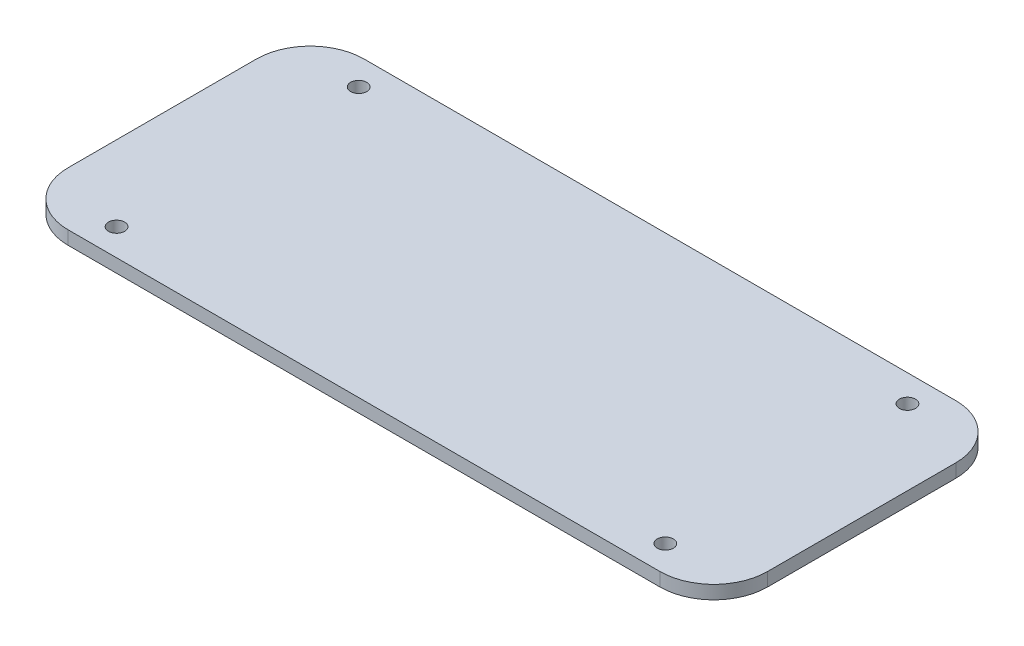
ISO-10303-21;
HEADER;
FILE_DESCRIPTION(('STEP AP214'),'2;1');
FILE_NAME('part.step','',(''),(''),'','','');
FILE_SCHEMA(('AUTOMOTIVE_DESIGN { 1 0 10303 214 1 1 1 1 }'));
ENDSEC;
DATA;
#1=APPLICATION_CONTEXT('core data for automotive mechanical design processes');
#2=APPLICATION_PROTOCOL_DEFINITION('international standard','automotive_design',2000,#1);
#3=PRODUCT_CONTEXT('',#1,'mechanical');
#4=PRODUCT('Part','Part','',(#3));
#5=PRODUCT_RELATED_PRODUCT_CATEGORY('part','',(#4));
#6=PRODUCT_DEFINITION_FORMATION('','',#4);
#7=PRODUCT_DEFINITION_CONTEXT('part definition',#1,'design');
#8=PRODUCT_DEFINITION('design','',#6,#7);
#9=PRODUCT_DEFINITION_SHAPE('','',#8);
#10=(LENGTH_UNIT() NAMED_UNIT(*) SI_UNIT(.MILLI.,.METRE.));
#11=(NAMED_UNIT(*) PLANE_ANGLE_UNIT() SI_UNIT($,.RADIAN.));
#12=(NAMED_UNIT(*) SI_UNIT($,.STERADIAN.) SOLID_ANGLE_UNIT());
#13=UNCERTAINTY_MEASURE_WITH_UNIT(LENGTH_MEASURE(1.E-05),#10,'distance_accuracy_value','');
#14=(GEOMETRIC_REPRESENTATION_CONTEXT(3) GLOBAL_UNCERTAINTY_ASSIGNED_CONTEXT((#13)) GLOBAL_UNIT_ASSIGNED_CONTEXT((#10,
#11,#12)) REPRESENTATION_CONTEXT('',''));
#15=CARTESIAN_POINT('',(0.,0.,0.));
#16=DIRECTION('',(0.,0.,1.));
#17=DIRECTION('',(1.,0.,0.));
#18=AXIS2_PLACEMENT_3D('',#15,#16,#17);
#19=CARTESIAN_POINT('',(10.,2.5,-45.));
#20=DIRECTION('',(0.,-1.,0.));
#21=DIRECTION('',(0.,0.,-1.));
#22=AXIS2_PLACEMENT_3D('',#19,#20,#21);
#23=CYLINDRICAL_SURFACE('',#22,10.);
#24=CARTESIAN_POINT('',(10.,0.,-45.));
#25=DIRECTION('',(0.,1.,0.));
#26=DIRECTION('',(0.,0.,1.));
#27=AXIS2_PLACEMENT_3D('',#24,#25,#26);
#28=CIRCLE('',#27,10.);
#29=CARTESIAN_POINT('',(10.0000000000001,0.,-55.));
#30=VERTEX_POINT('',#29);
#31=CARTESIAN_POINT('',(0.,0.,-44.9999999999999));
#32=VERTEX_POINT('',#31);
#33=EDGE_CURVE('E129',#30,#32,#28,.T.);
#34=ORIENTED_EDGE('',*,*,#33,.T.);
#35=DIRECTION('',(0.,-1.,0.));
#36=VECTOR('',#35,1.);
#37=CARTESIAN_POINT('',(0.,2.5,-44.9999999999999));
#38=LINE('',#37,#36);
#39=CARTESIAN_POINT('',(0.,2.5,-44.9999999999999));
#40=VERTEX_POINT('',#39);
#41=EDGE_CURVE('E11',#40,#32,#38,.T.);
#42=ORIENTED_EDGE('',*,*,#41,.F.);
#43=CARTESIAN_POINT('',(10.,2.5,-45.));
#44=DIRECTION('',(0.,1.,0.));
#45=DIRECTION('',(0.,0.,1.));
#46=AXIS2_PLACEMENT_3D('',#43,#44,#45);
#47=CIRCLE('',#46,10.);
#48=CARTESIAN_POINT('',(10.0000000000001,2.5,-55.));
#49=VERTEX_POINT('',#48);
#50=EDGE_CURVE('E144',#49,#40,#47,.T.);
#51=ORIENTED_EDGE('',*,*,#50,.F.);
#52=DIRECTION('',(0.,-1.,0.));
#53=VECTOR('',#52,1.);
#54=CARTESIAN_POINT('',(10.0000000000001,2.5,-55.));
#55=LINE('',#54,#53);
#56=EDGE_CURVE('E125',#49,#30,#55,.T.);
#57=ORIENTED_EDGE('',*,*,#56,.T.);
#58=EDGE_LOOP('',(#34,#42,#51,#57));
#59=FACE_BOUND('',#58,.T.);
#60=ADVANCED_FACE('F33',(#59),#23,.T.);
#61=CARTESIAN_POINT('',(0.,2.5,-10.0000000000001));
#62=DIRECTION('',(1.,0.,0.));
#63=DIRECTION('',(0.,0.,-1.));
#64=AXIS2_PLACEMENT_3D('',#61,#62,#63);
#65=PLANE('',#64);
#66=DIRECTION('',(0.,0.,1.));
#67=VECTOR('',#66,1.);
#68=CARTESIAN_POINT('',(0.,0.,-10.0000000000001));
#69=LINE('',#68,#67);
#70=CARTESIAN_POINT('',(0.,0.,-10.0000000000001));
#71=VERTEX_POINT('',#70);
#72=EDGE_CURVE('E132',#32,#71,#69,.T.);
#73=ORIENTED_EDGE('',*,*,#72,.T.);
#74=DIRECTION('',(0.,-1.,0.));
#75=VECTOR('',#74,1.);
#76=CARTESIAN_POINT('',(0.,2.5,-10.0000000000001));
#77=LINE('',#76,#75);
#78=CARTESIAN_POINT('',(0.,2.5,-10.0000000000001));
#79=VERTEX_POINT('',#78);
#80=EDGE_CURVE('E41',#79,#71,#77,.T.);
#81=ORIENTED_EDGE('',*,*,#80,.F.);
#82=DIRECTION('',(0.,0.,1.));
#83=VECTOR('',#82,1.);
#84=CARTESIAN_POINT('',(0.,2.5,-10.0000000000001));
#85=LINE('',#84,#83);
#86=EDGE_CURVE('E92',#40,#79,#85,.T.);
#87=ORIENTED_EDGE('',*,*,#86,.F.);
#88=ORIENTED_EDGE('',*,*,#41,.T.);
#89=EDGE_LOOP('',(#73,#81,#87,#88));
#90=FACE_BOUND('',#89,.T.);
#91=ADVANCED_FACE('F235',(#90),#65,.F.);
#92=CARTESIAN_POINT('',(10.,2.5,-10.));
#93=DIRECTION('',(0.,-1.,0.));
#94=DIRECTION('',(0.,0.,-1.));
#95=AXIS2_PLACEMENT_3D('',#92,#93,#94);
#96=CYLINDRICAL_SURFACE('',#95,10.);
#97=CARTESIAN_POINT('',(10.,0.,-10.));
#98=DIRECTION('',(0.,1.,0.));
#99=DIRECTION('',(0.,0.,1.));
#100=AXIS2_PLACEMENT_3D('',#97,#98,#99);
#101=CIRCLE('',#100,10.);
#102=CARTESIAN_POINT('',(10.0000000000001,0.,0.));
#103=VERTEX_POINT('',#102);
#104=EDGE_CURVE('E135',#71,#103,#101,.T.);
#105=ORIENTED_EDGE('',*,*,#104,.T.);
#106=DIRECTION('',(0.,-1.,0.));
#107=VECTOR('',#106,1.);
#108=CARTESIAN_POINT('',(10.0000000000001,2.5,0.));
#109=LINE('',#108,#107);
#110=CARTESIAN_POINT('',(10.0000000000001,2.5,0.));
#111=VERTEX_POINT('',#110);
#112=EDGE_CURVE('E151',#111,#103,#109,.T.);
#113=ORIENTED_EDGE('',*,*,#112,.F.);
#114=CARTESIAN_POINT('',(10.,2.5,-10.));
#115=DIRECTION('',(0.,1.,0.));
#116=DIRECTION('',(0.,0.,1.));
#117=AXIS2_PLACEMENT_3D('',#114,#115,#116);
#118=CIRCLE('',#117,10.);
#119=EDGE_CURVE('E159',#79,#111,#118,.T.);
#120=ORIENTED_EDGE('',*,*,#119,.F.);
#121=ORIENTED_EDGE('',*,*,#80,.T.);
#122=EDGE_LOOP('',(#105,#113,#120,#121));
#123=FACE_BOUND('',#122,.T.);
#124=ADVANCED_FACE('F157',(#123),#96,.T.);
#125=CARTESIAN_POINT('',(10.0000000000001,2.5,0.));
#126=DIRECTION('',(0.,0.,-1.));
#127=DIRECTION('',(-1.,0.,0.));
#128=AXIS2_PLACEMENT_3D('',#125,#126,#127);
#129=PLANE('',#128);
#130=DIRECTION('',(1.,0.,0.));
#131=VECTOR('',#130,1.);
#132=CARTESIAN_POINT('',(10.0000000000001,0.,0.));
#133=LINE('',#132,#131);
#134=CARTESIAN_POINT('',(120.,0.,0.));
#135=VERTEX_POINT('',#134);
#136=EDGE_CURVE('E137',#103,#135,#133,.T.);
#137=ORIENTED_EDGE('',*,*,#136,.T.);
#138=DIRECTION('',(0.,-1.,0.));
#139=VECTOR('',#138,1.);
#140=CARTESIAN_POINT('',(120.,2.5,0.));
#141=LINE('',#140,#139);
#142=CARTESIAN_POINT('',(120.,2.5,0.));
#143=VERTEX_POINT('',#142);
#144=EDGE_CURVE('E148',#143,#135,#141,.T.);
#145=ORIENTED_EDGE('',*,*,#144,.F.);
#146=DIRECTION('',(1.,0.,0.));
#147=VECTOR('',#146,1.);
#148=CARTESIAN_POINT('',(10.0000000000001,2.5,0.));
#149=LINE('',#148,#147);
#150=EDGE_CURVE('E171',#111,#143,#149,.T.);
#151=ORIENTED_EDGE('',*,*,#150,.F.);
#152=ORIENTED_EDGE('',*,*,#112,.T.);
#153=EDGE_LOOP('',(#137,#145,#151,#152));
#154=FACE_BOUND('',#153,.T.);
#155=ADVANCED_FACE('F167',(#154),#129,.F.);
#156=CARTESIAN_POINT('',(120.,2.5,-10.));
#157=DIRECTION('',(0.,-1.,0.));
#158=DIRECTION('',(0.,0.,-1.));
#159=AXIS2_PLACEMENT_3D('',#156,#157,#158);
#160=CYLINDRICAL_SURFACE('',#159,10.);
#161=CARTESIAN_POINT('',(120.,0.,-10.));
#162=DIRECTION('',(0.,1.,0.));
#163=DIRECTION('',(0.,0.,-1.));
#164=AXIS2_PLACEMENT_3D('',#161,#162,#163);
#165=CIRCLE('',#164,10.);
#166=CARTESIAN_POINT('',(130.,0.,-10.0000000000001));
#167=VERTEX_POINT('',#166);
#168=EDGE_CURVE('E139',#135,#167,#165,.T.);
#169=ORIENTED_EDGE('',*,*,#168,.T.);
#170=DIRECTION('',(0.,-1.,0.));
#171=VECTOR('',#170,1.);
#172=CARTESIAN_POINT('',(130.,2.5,-10.0000000000001));
#173=LINE('',#172,#171);
#174=CARTESIAN_POINT('',(130.,2.5,-10.0000000000001));
#175=VERTEX_POINT('',#174);
#176=EDGE_CURVE('E120',#175,#167,#173,.T.);
#177=ORIENTED_EDGE('',*,*,#176,.F.);
#178=CARTESIAN_POINT('',(120.,2.5,-10.));
#179=DIRECTION('',(0.,1.,0.));
#180=DIRECTION('',(0.,0.,-1.));
#181=AXIS2_PLACEMENT_3D('',#178,#179,#180);
#182=CIRCLE('',#181,10.);
#183=EDGE_CURVE('E111',#143,#175,#182,.T.);
#184=ORIENTED_EDGE('',*,*,#183,.F.);
#185=ORIENTED_EDGE('',*,*,#144,.T.);
#186=EDGE_LOOP('',(#169,#177,#184,#185));
#187=FACE_BOUND('',#186,.T.);
#188=ADVANCED_FACE('F170',(#187),#160,.T.);
#189=CARTESIAN_POINT('',(130.,2.5,-10.0000000000001));
#190=DIRECTION('',(-1.,0.,0.));
#191=DIRECTION('',(0.,0.,1.));
#192=AXIS2_PLACEMENT_3D('',#189,#190,#191);
#193=PLANE('',#192);
#194=DIRECTION('',(0.,0.,-1.));
#195=VECTOR('',#194,1.);
#196=CARTESIAN_POINT('',(130.,0.,-10.0000000000001));
#197=LINE('',#196,#195);
#198=CARTESIAN_POINT('',(130.,0.,-44.9999999999999));
#199=VERTEX_POINT('',#198);
#200=EDGE_CURVE('E119',#167,#199,#197,.T.);
#201=ORIENTED_EDGE('',*,*,#200,.T.);
#202=DIRECTION('',(0.,-1.,0.));
#203=VECTOR('',#202,1.);
#204=CARTESIAN_POINT('',(130.,2.5,-44.9999999999999));
#205=LINE('',#204,#203);
#206=CARTESIAN_POINT('',(130.,2.5,-44.9999999999999));
#207=VERTEX_POINT('',#206);
#208=EDGE_CURVE('E116',#207,#199,#205,.T.);
#209=ORIENTED_EDGE('',*,*,#208,.F.);
#210=DIRECTION('',(0.,0.,-1.));
#211=VECTOR('',#210,1.);
#212=CARTESIAN_POINT('',(130.,2.5,-10.0000000000001));
#213=LINE('',#212,#211);
#214=EDGE_CURVE('E105',#175,#207,#213,.T.);
#215=ORIENTED_EDGE('',*,*,#214,.F.);
#216=ORIENTED_EDGE('',*,*,#176,.T.);
#217=EDGE_LOOP('',(#201,#209,#215,#216));
#218=FACE_BOUND('',#217,.T.);
#219=ADVANCED_FACE('F117',(#218),#193,.F.);
#220=CARTESIAN_POINT('',(120.,2.5,-45.));
#221=DIRECTION('',(0.,-1.,0.));
#222=DIRECTION('',(0.,0.,-1.));
#223=AXIS2_PLACEMENT_3D('',#220,#221,#222);
#224=CYLINDRICAL_SURFACE('',#223,10.);
#225=CARTESIAN_POINT('',(120.,0.,-45.));
#226=DIRECTION('',(0.,1.,0.));
#227=DIRECTION('',(0.,0.,-1.));
#228=AXIS2_PLACEMENT_3D('',#225,#226,#227);
#229=CIRCLE('',#228,10.);
#230=CARTESIAN_POINT('',(120.,0.,-55.));
#231=VERTEX_POINT('',#230);
#232=EDGE_CURVE('E78',#199,#231,#229,.T.);
#233=ORIENTED_EDGE('',*,*,#232,.T.);
#234=DIRECTION('',(0.,-1.,0.));
#235=VECTOR('',#234,1.);
#236=CARTESIAN_POINT('',(120.,2.5,-55.));
#237=LINE('',#236,#235);
#238=CARTESIAN_POINT('',(120.,2.5,-55.));
#239=VERTEX_POINT('',#238);
#240=EDGE_CURVE('E121',#239,#231,#237,.T.);
#241=ORIENTED_EDGE('',*,*,#240,.F.);
#242=CARTESIAN_POINT('',(120.,2.5,-45.));
#243=DIRECTION('',(0.,1.,0.));
#244=DIRECTION('',(0.,0.,-1.));
#245=AXIS2_PLACEMENT_3D('',#242,#243,#244);
#246=CIRCLE('',#245,10.);
#247=EDGE_CURVE('E109',#207,#239,#246,.T.);
#248=ORIENTED_EDGE('',*,*,#247,.F.);
#249=ORIENTED_EDGE('',*,*,#208,.T.);
#250=EDGE_LOOP('',(#233,#241,#248,#249));
#251=FACE_BOUND('',#250,.T.);
#252=ADVANCED_FACE('F123',(#251),#224,.T.);
#253=CARTESIAN_POINT('',(10.0000000000001,2.5,-55.));
#254=DIRECTION('',(0.,0.,1.));
#255=DIRECTION('',(1.,0.,0.));
#256=AXIS2_PLACEMENT_3D('',#253,#254,#255);
#257=PLANE('',#256);
#258=DIRECTION('',(-1.,0.,0.));
#259=VECTOR('',#258,1.);
#260=CARTESIAN_POINT('',(10.0000000000001,0.,-55.));
#261=LINE('',#260,#259);
#262=EDGE_CURVE('E84',#231,#30,#261,.T.);
#263=ORIENTED_EDGE('',*,*,#262,.T.);
#264=ORIENTED_EDGE('',*,*,#56,.F.);
#265=DIRECTION('',(-1.,0.,0.));
#266=VECTOR('',#265,1.);
#267=CARTESIAN_POINT('',(10.0000000000001,2.5,-55.));
#268=LINE('',#267,#266);
#269=EDGE_CURVE('E49',#239,#49,#268,.T.);
#270=ORIENTED_EDGE('',*,*,#269,.F.);
#271=ORIENTED_EDGE('',*,*,#240,.T.);
#272=EDGE_LOOP('',(#263,#264,#270,#271));
#273=FACE_BOUND('',#272,.T.);
#274=ADVANCED_FACE('F212',(#273),#257,.F.);
#275=CARTESIAN_POINT('',(10.,2.5,-45.));
#276=DIRECTION('',(0.,1.,0.));
#277=DIRECTION('',(0.,0.,1.));
#278=AXIS2_PLACEMENT_3D('',#275,#276,#277);
#279=PLANE('',#278);
#280=CARTESIAN_POINT('',(116.,2.5,-50.));
#281=DIRECTION('',(0.,1.,0.));
#282=DIRECTION('',(0.,0.,-1.));
#283=AXIS2_PLACEMENT_3D('',#280,#281,#282);
#284=CIRCLE('',#283,1.5);
#285=CARTESIAN_POINT('',(116.,2.5,-51.5));
#286=VERTEX_POINT('',#285);
#287=EDGE_CURVE('E195',#286,#286,#284,.T.);
#288=ORIENTED_EDGE('',*,*,#287,.F.);
#289=EDGE_LOOP('',(#288));
#290=FACE_BOUND('',#289,.T.);
#291=CARTESIAN_POINT('',(116.,2.5,-4.99999999999997));
#292=DIRECTION('',(0.,1.,0.));
#293=DIRECTION('',(0.,0.,-1.));
#294=AXIS2_PLACEMENT_3D('',#291,#292,#293);
#295=CIRCLE('',#294,1.5);
#296=CARTESIAN_POINT('',(116.,2.5,-6.49999999999997));
#297=VERTEX_POINT('',#296);
#298=EDGE_CURVE('E189',#297,#297,#295,.T.);
#299=ORIENTED_EDGE('',*,*,#298,.F.);
#300=EDGE_LOOP('',(#299));
#301=FACE_BOUND('',#300,.T.);
#302=CARTESIAN_POINT('',(14.,2.5,-50.));
#303=DIRECTION('',(0.,1.,0.));
#304=DIRECTION('',(0.,0.,1.));
#305=AXIS2_PLACEMENT_3D('',#302,#303,#304);
#306=CIRCLE('',#305,1.5);
#307=CARTESIAN_POINT('',(14.,2.5,-48.5));
#308=VERTEX_POINT('',#307);
#309=EDGE_CURVE('E183',#308,#308,#306,.T.);
#310=ORIENTED_EDGE('',*,*,#309,.F.);
#311=EDGE_LOOP('',(#310));
#312=FACE_BOUND('',#311,.T.);
#313=CARTESIAN_POINT('',(14.,2.5,-5.));
#314=DIRECTION('',(0.,1.,0.));
#315=DIRECTION('',(0.,0.,1.));
#316=AXIS2_PLACEMENT_3D('',#313,#314,#315);
#317=CIRCLE('',#316,1.5);
#318=CARTESIAN_POINT('',(14.,2.5,-3.5));
#319=VERTEX_POINT('',#318);
#320=EDGE_CURVE('E177',#319,#319,#317,.T.);
#321=ORIENTED_EDGE('',*,*,#320,.F.);
#322=EDGE_LOOP('',(#321));
#323=FACE_BOUND('',#322,.T.);
#324=ORIENTED_EDGE('',*,*,#50,.T.);
#325=ORIENTED_EDGE('',*,*,#86,.T.);
#326=ORIENTED_EDGE('',*,*,#119,.T.);
#327=ORIENTED_EDGE('',*,*,#150,.T.);
#328=ORIENTED_EDGE('',*,*,#183,.T.);
#329=ORIENTED_EDGE('',*,*,#214,.T.);
#330=ORIENTED_EDGE('',*,*,#247,.T.);
#331=ORIENTED_EDGE('',*,*,#269,.T.);
#332=EDGE_LOOP('',(#324,#325,#326,#327,#328,#329,#330,#331));
#333=FACE_BOUND('',#332,.T.);
#334=ADVANCED_FACE('F107',(#290,#301,#312,#323,#333),#279,.T.);
#335=CARTESIAN_POINT('',(10.,0.,-45.));
#336=DIRECTION('',(0.,1.,0.));
#337=DIRECTION('',(0.,0.,1.));
#338=AXIS2_PLACEMENT_3D('',#335,#336,#337);
#339=PLANE('',#338);
#340=CARTESIAN_POINT('',(116.,0.,-50.));
#341=DIRECTION('',(0.,1.,0.));
#342=DIRECTION('',(0.,0.,-1.));
#343=AXIS2_PLACEMENT_3D('',#340,#341,#342);
#344=CIRCLE('',#343,1.5);
#345=CARTESIAN_POINT('',(116.,0.,-51.5));
#346=VERTEX_POINT('',#345);
#347=EDGE_CURVE('E192',#346,#346,#344,.T.);
#348=ORIENTED_EDGE('',*,*,#347,.T.);
#349=EDGE_LOOP('',(#348));
#350=FACE_BOUND('',#349,.T.);
#351=CARTESIAN_POINT('',(116.,0.,-4.99999999999997));
#352=DIRECTION('',(0.,1.,0.));
#353=DIRECTION('',(0.,0.,-1.));
#354=AXIS2_PLACEMENT_3D('',#351,#352,#353);
#355=CIRCLE('',#354,1.5);
#356=CARTESIAN_POINT('',(116.,0.,-6.49999999999997));
#357=VERTEX_POINT('',#356);
#358=EDGE_CURVE('E186',#357,#357,#355,.T.);
#359=ORIENTED_EDGE('',*,*,#358,.T.);
#360=EDGE_LOOP('',(#359));
#361=FACE_BOUND('',#360,.T.);
#362=CARTESIAN_POINT('',(14.,0.,-50.));
#363=DIRECTION('',(0.,1.,0.));
#364=DIRECTION('',(0.,0.,1.));
#365=AXIS2_PLACEMENT_3D('',#362,#363,#364);
#366=CIRCLE('',#365,1.5);
#367=CARTESIAN_POINT('',(14.,0.,-48.5));
#368=VERTEX_POINT('',#367);
#369=EDGE_CURVE('E180',#368,#368,#366,.T.);
#370=ORIENTED_EDGE('',*,*,#369,.T.);
#371=EDGE_LOOP('',(#370));
#372=FACE_BOUND('',#371,.T.);
#373=CARTESIAN_POINT('',(14.,0.,-5.));
#374=DIRECTION('',(0.,1.,0.));
#375=DIRECTION('',(0.,0.,1.));
#376=AXIS2_PLACEMENT_3D('',#373,#374,#375);
#377=CIRCLE('',#376,1.5);
#378=CARTESIAN_POINT('',(14.,0.,-3.5));
#379=VERTEX_POINT('',#378);
#380=EDGE_CURVE('E133',#379,#379,#377,.T.);
#381=ORIENTED_EDGE('',*,*,#380,.T.);
#382=EDGE_LOOP('',(#381));
#383=FACE_BOUND('',#382,.T.);
#384=ORIENTED_EDGE('',*,*,#33,.F.);
#385=ORIENTED_EDGE('',*,*,#262,.F.);
#386=ORIENTED_EDGE('',*,*,#232,.F.);
#387=ORIENTED_EDGE('',*,*,#200,.F.);
#388=ORIENTED_EDGE('',*,*,#168,.F.);
#389=ORIENTED_EDGE('',*,*,#136,.F.);
#390=ORIENTED_EDGE('',*,*,#104,.F.);
#391=ORIENTED_EDGE('',*,*,#72,.F.);
#392=EDGE_LOOP('',(#384,#385,#386,#387,#388,#389,#390,#391));
#393=FACE_BOUND('',#392,.T.);
#394=ADVANCED_FACE('F163',(#350,#361,#372,#383,#393),#339,.F.);
#395=CARTESIAN_POINT('',(14.,0.,-5.));
#396=DIRECTION('',(0.,1.,0.));
#397=DIRECTION('',(0.,0.,1.));
#398=AXIS2_PLACEMENT_3D('',#395,#396,#397);
#399=CYLINDRICAL_SURFACE('',#398,1.5);
#400=ORIENTED_EDGE('',*,*,#380,.F.);
#401=EDGE_LOOP('',(#400));
#402=FACE_BOUND('',#401,.T.);
#403=ORIENTED_EDGE('',*,*,#320,.T.);
#404=EDGE_LOOP('',(#403));
#405=FACE_BOUND('',#404,.T.);
#406=ADVANCED_FACE('F220',(#402,#405),#399,.F.);
#407=CARTESIAN_POINT('',(14.,0.,-50.));
#408=DIRECTION('',(0.,1.,0.));
#409=DIRECTION('',(0.,0.,1.));
#410=AXIS2_PLACEMENT_3D('',#407,#408,#409);
#411=CYLINDRICAL_SURFACE('',#410,1.5);
#412=ORIENTED_EDGE('',*,*,#369,.F.);
#413=EDGE_LOOP('',(#412));
#414=FACE_BOUND('',#413,.T.);
#415=ORIENTED_EDGE('',*,*,#309,.T.);
#416=EDGE_LOOP('',(#415));
#417=FACE_BOUND('',#416,.T.);
#418=ADVANCED_FACE('F222',(#414,#417),#411,.F.);
#419=CARTESIAN_POINT('',(116.,0.,-4.99999999999997));
#420=DIRECTION('',(0.,1.,0.));
#421=DIRECTION('',(0.,0.,1.));
#422=AXIS2_PLACEMENT_3D('',#419,#420,#421);
#423=CYLINDRICAL_SURFACE('',#422,1.5);
#424=ORIENTED_EDGE('',*,*,#358,.F.);
#425=EDGE_LOOP('',(#424));
#426=FACE_BOUND('',#425,.T.);
#427=ORIENTED_EDGE('',*,*,#298,.T.);
#428=EDGE_LOOP('',(#427));
#429=FACE_BOUND('',#428,.T.);
#430=ADVANCED_FACE('F206',(#426,#429),#423,.F.);
#431=CARTESIAN_POINT('',(116.,0.,-50.));
#432=DIRECTION('',(0.,1.,0.));
#433=DIRECTION('',(0.,0.,1.));
#434=AXIS2_PLACEMENT_3D('',#431,#432,#433);
#435=CYLINDRICAL_SURFACE('',#434,1.5);
#436=ORIENTED_EDGE('',*,*,#347,.F.);
#437=EDGE_LOOP('',(#436));
#438=FACE_BOUND('',#437,.T.);
#439=ORIENTED_EDGE('',*,*,#287,.T.);
#440=EDGE_LOOP('',(#439));
#441=FACE_BOUND('',#440,.T.);
#442=ADVANCED_FACE('F203',(#438,#441),#435,.F.);
#443=CLOSED_SHELL('',(#60,#91,#124,#155,#188,#219,#252,#274,#334,#394,#406,#418,#430,#442));
#444=MANIFOLD_SOLID_BREP('B2',#443);
#445=ADVANCED_BREP_SHAPE_REPRESENTATION('',(#18,#444),#14);
#446=SHAPE_DEFINITION_REPRESENTATION(#9,#445);
ENDSEC;
END-ISO-10303-21;
